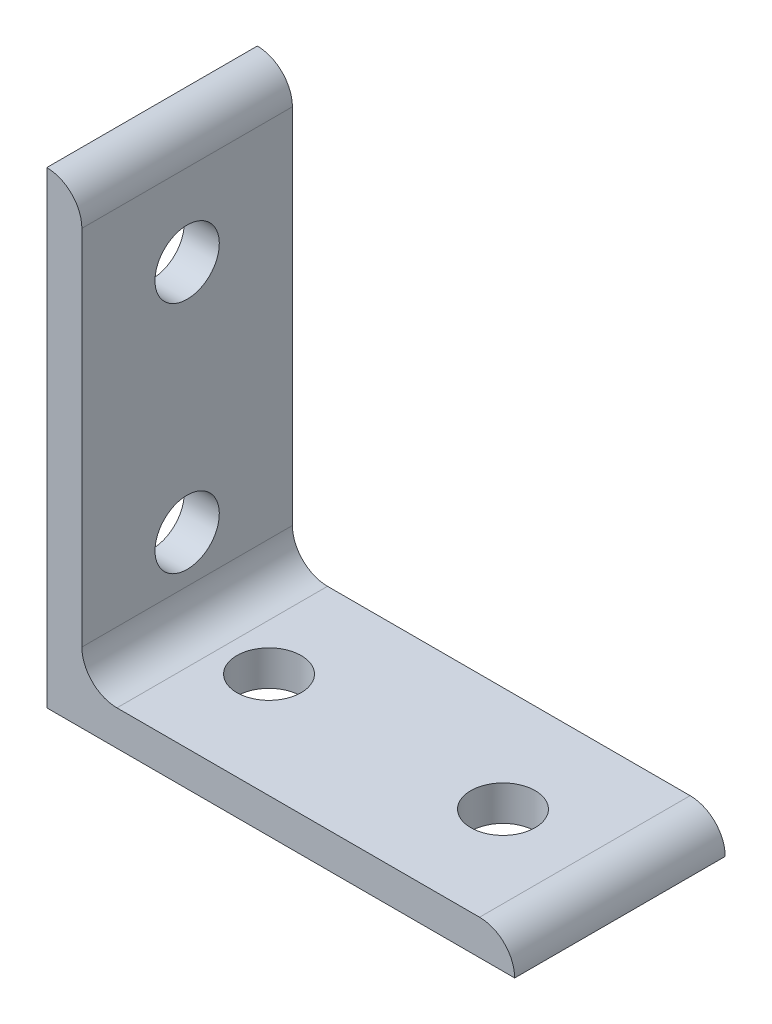
ISO-10303-21;
HEADER;
FILE_DESCRIPTION(('STEP AP214'),'2;1');
FILE_NAME('part.step','',(''),(''),'','','');
FILE_SCHEMA(('AUTOMOTIVE_DESIGN { 1 0 10303 214 1 1 1 1 }'));
ENDSEC;
DATA;
#1=APPLICATION_CONTEXT('core data for automotive mechanical design processes');
#2=APPLICATION_PROTOCOL_DEFINITION('international standard','automotive_design',2000,#1);
#3=PRODUCT_CONTEXT('',#1,'mechanical');
#4=PRODUCT('Part','Part','',(#3));
#5=PRODUCT_RELATED_PRODUCT_CATEGORY('part','',(#4));
#6=PRODUCT_DEFINITION_FORMATION('','',#4);
#7=PRODUCT_DEFINITION_CONTEXT('part definition',#1,'design');
#8=PRODUCT_DEFINITION('design','',#6,#7);
#9=PRODUCT_DEFINITION_SHAPE('','',#8);
#10=(LENGTH_UNIT() NAMED_UNIT(*) SI_UNIT(.MILLI.,.METRE.));
#11=(NAMED_UNIT(*) PLANE_ANGLE_UNIT() SI_UNIT($,.RADIAN.));
#12=(NAMED_UNIT(*) SI_UNIT($,.STERADIAN.) SOLID_ANGLE_UNIT());
#13=UNCERTAINTY_MEASURE_WITH_UNIT(LENGTH_MEASURE(1.E-05),#10,'distance_accuracy_value','');
#14=(GEOMETRIC_REPRESENTATION_CONTEXT(3) GLOBAL_UNCERTAINTY_ASSIGNED_CONTEXT((#13)) GLOBAL_UNIT_ASSIGNED_CONTEXT((#10,
#11,#12)) REPRESENTATION_CONTEXT('',''));
#15=CARTESIAN_POINT('',(0.,0.,0.));
#16=DIRECTION('',(0.,0.,1.));
#17=DIRECTION('',(1.,0.,0.));
#18=AXIS2_PLACEMENT_3D('',#15,#16,#17);
#19=CARTESIAN_POINT('',(3.,37.,9.));
#20=DIRECTION('',(-1.,0.,0.));
#21=DIRECTION('',(0.,-1.,0.));
#22=AXIS2_PLACEMENT_3D('',#19,#20,#21);
#23=PLANE('',#22);
#24=CARTESIAN_POINT('',(3.,10.,0.));
#25=DIRECTION('',(-1.,0.,0.));
#26=DIRECTION('',(0.,-1.,0.));
#27=AXIS2_PLACEMENT_3D('',#24,#25,#26);
#28=CIRCLE('',#27,2.75);
#29=CARTESIAN_POINT('',(3.,7.25000000000001,0.));
#30=VERTEX_POINT('',#29);
#31=EDGE_CURVE('E196',#30,#30,#28,.F.);
#32=ORIENTED_EDGE('',*,*,#31,.F.);
#33=EDGE_LOOP('',(#32));
#34=FACE_BOUND('',#33,.T.);
#35=DIRECTION('',(0.,1.,0.));
#36=VECTOR('',#35,1.);
#37=CARTESIAN_POINT('',(3.,37.,-9.));
#38=LINE('',#37,#36);
#39=CARTESIAN_POINT('',(3.,6.,-9.));
#40=VERTEX_POINT('',#39);
#41=CARTESIAN_POINT('',(3.,37.,-9.));
#42=VERTEX_POINT('',#41);
#43=EDGE_CURVE('E117',#40,#42,#38,.T.);
#44=ORIENTED_EDGE('',*,*,#43,.T.);
#45=DIRECTION('',(0.,0.,-1.));
#46=VECTOR('',#45,1.);
#47=CARTESIAN_POINT('',(3.,37.,9.));
#48=LINE('',#47,#46);
#49=CARTESIAN_POINT('',(3.,37.,9.));
#50=VERTEX_POINT('',#49);
#51=EDGE_CURVE('E114',#50,#42,#48,.T.);
#52=ORIENTED_EDGE('',*,*,#51,.F.);
#53=DIRECTION('',(0.,1.,0.));
#54=VECTOR('',#53,1.);
#55=CARTESIAN_POINT('',(3.,37.,9.));
#56=LINE('',#55,#54);
#57=CARTESIAN_POINT('',(3.,6.,9.));
#58=VERTEX_POINT('',#57);
#59=EDGE_CURVE('E103',#58,#50,#56,.T.);
#60=ORIENTED_EDGE('',*,*,#59,.F.);
#61=DIRECTION('',(0.,0.,-1.));
#62=VECTOR('',#61,1.);
#63=CARTESIAN_POINT('',(3.,6.,9.));
#64=LINE('',#63,#62);
#65=EDGE_CURVE('E118',#58,#40,#64,.T.);
#66=ORIENTED_EDGE('',*,*,#65,.T.);
#67=EDGE_LOOP('',(#44,#52,#60,#66));
#68=FACE_BOUND('',#67,.T.);
#69=CARTESIAN_POINT('',(3.,30.,0.));
#70=DIRECTION('',(-1.,0.,0.));
#71=DIRECTION('',(0.,-1.,0.));
#72=AXIS2_PLACEMENT_3D('',#69,#70,#71);
#73=CIRCLE('',#72,2.75);
#74=CARTESIAN_POINT('',(3.,27.25,0.));
#75=VERTEX_POINT('',#74);
#76=EDGE_CURVE('E189',#75,#75,#73,.F.);
#77=ORIENTED_EDGE('',*,*,#76,.F.);
#78=EDGE_LOOP('',(#77));
#79=FACE_BOUND('',#78,.T.);
#80=ADVANCED_FACE('F34',(#34,#68,#79),#23,.F.);
#81=CARTESIAN_POINT('',(0.,0.,9.));
#82=DIRECTION('',(1.,0.,0.));
#83=DIRECTION('',(0.,0.,-1.));
#84=AXIS2_PLACEMENT_3D('',#81,#82,#83);
#85=PLANE('',#84);
#86=CARTESIAN_POINT('',(0.,10.,0.));
#87=DIRECTION('',(1.,0.,0.));
#88=DIRECTION('',(0.,0.,-1.));
#89=AXIS2_PLACEMENT_3D('',#86,#87,#88);
#90=CIRCLE('',#89,2.75);
#91=CARTESIAN_POINT('',(0.,10.,-2.75));
#92=VERTEX_POINT('',#91);
#93=EDGE_CURVE('E192',#92,#92,#90,.T.);
#94=ORIENTED_EDGE('',*,*,#93,.T.);
#95=EDGE_LOOP('',(#94));
#96=FACE_BOUND('',#95,.T.);
#97=DIRECTION('',(0.,-1.,0.));
#98=VECTOR('',#97,1.);
#99=CARTESIAN_POINT('',(0.,0.,-9.));
#100=LINE('',#99,#98);
#101=CARTESIAN_POINT('',(0.,40.,-9.));
#102=VERTEX_POINT('',#101);
#103=CARTESIAN_POINT('',(0.,0.,-9.));
#104=VERTEX_POINT('',#103);
#105=EDGE_CURVE('E85',#102,#104,#100,.T.);
#106=ORIENTED_EDGE('',*,*,#105,.T.);
#107=DIRECTION('',(0.,0.,-1.));
#108=VECTOR('',#107,1.);
#109=CARTESIAN_POINT('',(0.,0.,9.));
#110=LINE('',#109,#108);
#111=CARTESIAN_POINT('',(0.,0.,9.));
#112=VERTEX_POINT('',#111);
#113=EDGE_CURVE('E123',#112,#104,#110,.T.);
#114=ORIENTED_EDGE('',*,*,#113,.F.);
#115=DIRECTION('',(0.,-1.,0.));
#116=VECTOR('',#115,1.);
#117=CARTESIAN_POINT('',(0.,0.,9.));
#118=LINE('',#117,#116);
#119=CARTESIAN_POINT('',(0.,40.,9.));
#120=VERTEX_POINT('',#119);
#121=EDGE_CURVE('E53',#120,#112,#118,.T.);
#122=ORIENTED_EDGE('',*,*,#121,.F.);
#123=DIRECTION('',(0.,0.,-1.));
#124=VECTOR('',#123,1.);
#125=CARTESIAN_POINT('',(0.,40.,9.));
#126=LINE('',#125,#124);
#127=EDGE_CURVE('E119',#120,#102,#126,.T.);
#128=ORIENTED_EDGE('',*,*,#127,.T.);
#129=EDGE_LOOP('',(#106,#114,#122,#128));
#130=FACE_BOUND('',#129,.T.);
#131=CARTESIAN_POINT('',(0.,30.,0.));
#132=DIRECTION('',(1.,0.,0.));
#133=DIRECTION('',(0.,0.,-1.));
#134=AXIS2_PLACEMENT_3D('',#131,#132,#133);
#135=CIRCLE('',#134,2.75);
#136=CARTESIAN_POINT('',(0.,30.,-2.75));
#137=VERTEX_POINT('',#136);
#138=EDGE_CURVE('E187',#137,#137,#135,.T.);
#139=ORIENTED_EDGE('',*,*,#138,.T.);
#140=EDGE_LOOP('',(#139));
#141=FACE_BOUND('',#140,.T.);
#142=ADVANCED_FACE('F180',(#96,#130,#141),#85,.F.);
#143=CARTESIAN_POINT('',(40.,0.,9.));
#144=DIRECTION('',(0.,1.,0.));
#145=DIRECTION('',(-1.,0.,0.));
#146=AXIS2_PLACEMENT_3D('',#143,#144,#145);
#147=PLANE('',#146);
#148=CARTESIAN_POINT('',(10.,0.,0.));
#149=DIRECTION('',(0.,1.,0.));
#150=DIRECTION('',(0.,0.,1.));
#151=AXIS2_PLACEMENT_3D('',#148,#149,#150);
#152=CIRCLE('',#151,2.75);
#153=CARTESIAN_POINT('',(10.,0.,2.75));
#154=VERTEX_POINT('',#153);
#155=EDGE_CURVE('E149',#154,#154,#152,.T.);
#156=ORIENTED_EDGE('',*,*,#155,.T.);
#157=EDGE_LOOP('',(#156));
#158=FACE_BOUND('',#157,.T.);
#159=DIRECTION('',(1.,0.,0.));
#160=VECTOR('',#159,1.);
#161=CARTESIAN_POINT('',(40.,0.,-9.));
#162=LINE('',#161,#160);
#163=CARTESIAN_POINT('',(40.,0.,-9.));
#164=VERTEX_POINT('',#163);
#165=EDGE_CURVE('E127',#104,#164,#162,.T.);
#166=ORIENTED_EDGE('',*,*,#165,.T.);
#167=DIRECTION('',(0.,0.,-1.));
#168=VECTOR('',#167,1.);
#169=CARTESIAN_POINT('',(40.,0.,9.));
#170=LINE('',#169,#168);
#171=CARTESIAN_POINT('',(40.,0.,9.));
#172=VERTEX_POINT('',#171);
#173=EDGE_CURVE('E11',#172,#164,#170,.T.);
#174=ORIENTED_EDGE('',*,*,#173,.F.);
#175=DIRECTION('',(1.,0.,0.));
#176=VECTOR('',#175,1.);
#177=CARTESIAN_POINT('',(40.,0.,9.));
#178=LINE('',#177,#176);
#179=EDGE_CURVE('E140',#112,#172,#178,.T.);
#180=ORIENTED_EDGE('',*,*,#179,.F.);
#181=ORIENTED_EDGE('',*,*,#113,.T.);
#182=EDGE_LOOP('',(#166,#174,#180,#181));
#183=FACE_BOUND('',#182,.T.);
#184=CARTESIAN_POINT('',(30.,0.,0.));
#185=DIRECTION('',(0.,1.,0.));
#186=DIRECTION('',(0.,0.,1.));
#187=AXIS2_PLACEMENT_3D('',#184,#185,#186);
#188=CIRCLE('',#187,2.74999999999999);
#189=CARTESIAN_POINT('',(30.,0.,2.74999999999999));
#190=VERTEX_POINT('',#189);
#191=EDGE_CURVE('E157',#190,#190,#188,.T.);
#192=ORIENTED_EDGE('',*,*,#191,.T.);
#193=EDGE_LOOP('',(#192));
#194=FACE_BOUND('',#193,.T.);
#195=ADVANCED_FACE('F36',(#158,#183,#194),#147,.F.);
#196=CARTESIAN_POINT('',(6.,3.,9.));
#197=DIRECTION('',(0.,-1.,0.));
#198=DIRECTION('',(1.,0.,0.));
#199=AXIS2_PLACEMENT_3D('',#196,#197,#198);
#200=PLANE('',#199);
#201=CARTESIAN_POINT('',(10.,3.,0.));
#202=DIRECTION('',(0.,-1.,0.));
#203=DIRECTION('',(1.,0.,0.));
#204=AXIS2_PLACEMENT_3D('',#201,#202,#203);
#205=CIRCLE('',#204,2.75);
#206=CARTESIAN_POINT('',(12.75,3.,0.));
#207=VERTEX_POINT('',#206);
#208=EDGE_CURVE('E131',#207,#207,#205,.F.);
#209=ORIENTED_EDGE('',*,*,#208,.F.);
#210=EDGE_LOOP('',(#209));
#211=FACE_BOUND('',#210,.T.);
#212=DIRECTION('',(-1.,0.,0.));
#213=VECTOR('',#212,1.);
#214=CARTESIAN_POINT('',(6.,3.,-9.));
#215=LINE('',#214,#213);
#216=CARTESIAN_POINT('',(37.,3.,-9.));
#217=VERTEX_POINT('',#216);
#218=CARTESIAN_POINT('',(6.,3.,-9.));
#219=VERTEX_POINT('',#218);
#220=EDGE_CURVE('E133',#217,#219,#215,.T.);
#221=ORIENTED_EDGE('',*,*,#220,.T.);
#222=DIRECTION('',(0.,0.,-1.));
#223=VECTOR('',#222,1.);
#224=CARTESIAN_POINT('',(6.,3.,9.));
#225=LINE('',#224,#223);
#226=CARTESIAN_POINT('',(6.,3.,9.));
#227=VERTEX_POINT('',#226);
#228=EDGE_CURVE('E144',#227,#219,#225,.T.);
#229=ORIENTED_EDGE('',*,*,#228,.F.);
#230=DIRECTION('',(-1.,0.,0.));
#231=VECTOR('',#230,1.);
#232=CARTESIAN_POINT('',(6.,3.,9.));
#233=LINE('',#232,#231);
#234=CARTESIAN_POINT('',(37.,3.,9.));
#235=VERTEX_POINT('',#234);
#236=EDGE_CURVE('E163',#235,#227,#233,.T.);
#237=ORIENTED_EDGE('',*,*,#236,.F.);
#238=DIRECTION('',(0.,0.,-1.));
#239=VECTOR('',#238,1.);
#240=CARTESIAN_POINT('',(37.,3.,9.));
#241=LINE('',#240,#239);
#242=EDGE_CURVE('E44',#235,#217,#241,.T.);
#243=ORIENTED_EDGE('',*,*,#242,.T.);
#244=EDGE_LOOP('',(#221,#229,#237,#243));
#245=FACE_BOUND('',#244,.T.);
#246=CARTESIAN_POINT('',(30.,3.,0.));
#247=DIRECTION('',(0.,-1.,0.));
#248=DIRECTION('',(1.,0.,0.));
#249=AXIS2_PLACEMENT_3D('',#246,#247,#248);
#250=CIRCLE('',#249,2.74999999999999);
#251=CARTESIAN_POINT('',(32.75,3.,0.));
#252=VERTEX_POINT('',#251);
#253=EDGE_CURVE('E38',#252,#252,#250,.F.);
#254=ORIENTED_EDGE('',*,*,#253,.F.);
#255=EDGE_LOOP('',(#254));
#256=FACE_BOUND('',#255,.T.);
#257=ADVANCED_FACE('F167',(#211,#245,#256),#200,.F.);
#258=CARTESIAN_POINT('',(37.,0.,9.));
#259=DIRECTION('',(0.,0.,-1.));
#260=DIRECTION('',(-1.,0.,0.));
#261=AXIS2_PLACEMENT_3D('',#258,#259,#260);
#262=CYLINDRICAL_SURFACE('',#261,3.00000000000001);
#263=CARTESIAN_POINT('',(37.,0.,-9.));
#264=DIRECTION('',(0.,0.,1.));
#265=DIRECTION('',(1.,0.,0.));
#266=AXIS2_PLACEMENT_3D('',#263,#264,#265);
#267=CIRCLE('',#266,3.00000000000001);
#268=EDGE_CURVE('E130',#164,#217,#267,.T.);
#269=ORIENTED_EDGE('',*,*,#268,.T.);
#270=ORIENTED_EDGE('',*,*,#242,.F.);
#271=CARTESIAN_POINT('',(37.,0.,9.));
#272=DIRECTION('',(0.,0.,1.));
#273=DIRECTION('',(1.,0.,0.));
#274=AXIS2_PLACEMENT_3D('',#271,#272,#273);
#275=CIRCLE('',#274,3.00000000000001);
#276=EDGE_CURVE('E93',#172,#235,#275,.T.);
#277=ORIENTED_EDGE('',*,*,#276,.F.);
#278=ORIENTED_EDGE('',*,*,#173,.T.);
#279=EDGE_LOOP('',(#269,#270,#277,#278));
#280=FACE_BOUND('',#279,.T.);
#281=ADVANCED_FACE('F211',(#280),#262,.T.);
#282=CARTESIAN_POINT('',(6.,6.,9.));
#283=DIRECTION('',(0.,0.,-1.));
#284=DIRECTION('',(-1.,0.,0.));
#285=AXIS2_PLACEMENT_3D('',#282,#283,#284);
#286=CYLINDRICAL_SURFACE('',#285,3.);
#287=CARTESIAN_POINT('',(6.,6.,-9.));
#288=DIRECTION('',(0.,0.,-1.));
#289=DIRECTION('',(1.,0.,0.));
#290=AXIS2_PLACEMENT_3D('',#287,#288,#289);
#291=CIRCLE('',#290,3.);
#292=EDGE_CURVE('E135',#219,#40,#291,.T.);
#293=ORIENTED_EDGE('',*,*,#292,.T.);
#294=ORIENTED_EDGE('',*,*,#65,.F.);
#295=CARTESIAN_POINT('',(6.,6.,9.));
#296=DIRECTION('',(0.,0.,-1.));
#297=DIRECTION('',(1.,0.,0.));
#298=AXIS2_PLACEMENT_3D('',#295,#296,#297);
#299=CIRCLE('',#298,3.);
#300=EDGE_CURVE('E109',#227,#58,#299,.T.);
#301=ORIENTED_EDGE('',*,*,#300,.F.);
#302=ORIENTED_EDGE('',*,*,#228,.T.);
#303=EDGE_LOOP('',(#293,#294,#301,#302));
#304=FACE_BOUND('',#303,.T.);
#305=ADVANCED_FACE('F172',(#304),#286,.F.);
#306=CARTESIAN_POINT('',(0.,37.,9.));
#307=DIRECTION('',(0.,0.,-1.));
#308=DIRECTION('',(-1.,0.,0.));
#309=AXIS2_PLACEMENT_3D('',#306,#307,#308);
#310=CYLINDRICAL_SURFACE('',#309,3.00000000000001);
#311=CARTESIAN_POINT('',(0.,37.,-9.));
#312=DIRECTION('',(0.,0.,1.));
#313=DIRECTION('',(1.,0.,0.));
#314=AXIS2_PLACEMENT_3D('',#311,#312,#313);
#315=CIRCLE('',#314,3.00000000000001);
#316=EDGE_CURVE('E79',#42,#102,#315,.T.);
#317=ORIENTED_EDGE('',*,*,#316,.T.);
#318=ORIENTED_EDGE('',*,*,#127,.F.);
#319=CARTESIAN_POINT('',(0.,37.,9.));
#320=DIRECTION('',(0.,0.,1.));
#321=DIRECTION('',(1.,0.,0.));
#322=AXIS2_PLACEMENT_3D('',#319,#320,#321);
#323=CIRCLE('',#322,3.00000000000001);
#324=EDGE_CURVE('E107',#50,#120,#323,.T.);
#325=ORIENTED_EDGE('',*,*,#324,.F.);
#326=ORIENTED_EDGE('',*,*,#51,.T.);
#327=EDGE_LOOP('',(#317,#318,#325,#326));
#328=FACE_BOUND('',#327,.T.);
#329=ADVANCED_FACE('F121',(#328),#310,.T.);
#330=CARTESIAN_POINT('',(0.,37.,9.));
#331=DIRECTION('',(0.,0.,1.));
#332=DIRECTION('',(1.,0.,0.));
#333=AXIS2_PLACEMENT_3D('',#330,#331,#332);
#334=PLANE('',#333);
#335=ORIENTED_EDGE('',*,*,#179,.T.);
#336=ORIENTED_EDGE('',*,*,#276,.T.);
#337=ORIENTED_EDGE('',*,*,#236,.T.);
#338=ORIENTED_EDGE('',*,*,#300,.T.);
#339=ORIENTED_EDGE('',*,*,#59,.T.);
#340=ORIENTED_EDGE('',*,*,#324,.T.);
#341=ORIENTED_EDGE('',*,*,#121,.T.);
#342=EDGE_LOOP('',(#335,#336,#337,#338,#339,#340,#341));
#343=FACE_BOUND('',#342,.T.);
#344=ADVANCED_FACE('F105',(#343),#334,.T.);
#345=CARTESIAN_POINT('',(0.,37.,-9.));
#346=DIRECTION('',(0.,0.,1.));
#347=DIRECTION('',(1.,0.,0.));
#348=AXIS2_PLACEMENT_3D('',#345,#346,#347);
#349=PLANE('',#348);
#350=ORIENTED_EDGE('',*,*,#165,.F.);
#351=ORIENTED_EDGE('',*,*,#105,.F.);
#352=ORIENTED_EDGE('',*,*,#316,.F.);
#353=ORIENTED_EDGE('',*,*,#43,.F.);
#354=ORIENTED_EDGE('',*,*,#292,.F.);
#355=ORIENTED_EDGE('',*,*,#220,.F.);
#356=ORIENTED_EDGE('',*,*,#268,.F.);
#357=EDGE_LOOP('',(#350,#351,#352,#353,#354,#355,#356));
#358=FACE_BOUND('',#357,.T.);
#359=ADVANCED_FACE('F175',(#358),#349,.F.);
#360=CARTESIAN_POINT('',(10.,40.,0.));
#361=DIRECTION('',(0.,-1.,0.));
#362=DIRECTION('',(0.,0.,-1.));
#363=AXIS2_PLACEMENT_3D('',#360,#361,#362);
#364=CYLINDRICAL_SURFACE('',#363,2.75);
#365=ORIENTED_EDGE('',*,*,#155,.F.);
#366=EDGE_LOOP('',(#365));
#367=FACE_BOUND('',#366,.T.);
#368=ORIENTED_EDGE('',*,*,#208,.T.);
#369=EDGE_LOOP('',(#368));
#370=FACE_BOUND('',#369,.T.);
#371=ADVANCED_FACE('F207',(#367,#370),#364,.F.);
#372=CARTESIAN_POINT('',(30.,40.,0.));
#373=DIRECTION('',(0.,-1.,0.));
#374=DIRECTION('',(0.,0.,-1.));
#375=AXIS2_PLACEMENT_3D('',#372,#373,#374);
#376=CYLINDRICAL_SURFACE('',#375,2.74999999999999);
#377=ORIENTED_EDGE('',*,*,#191,.F.);
#378=EDGE_LOOP('',(#377));
#379=FACE_BOUND('',#378,.T.);
#380=ORIENTED_EDGE('',*,*,#253,.T.);
#381=EDGE_LOOP('',(#380));
#382=FACE_BOUND('',#381,.T.);
#383=ADVANCED_FACE('F203',(#379,#382),#376,.F.);
#384=CARTESIAN_POINT('',(40.,10.,0.));
#385=DIRECTION('',(-1.,0.,0.));
#386=DIRECTION('',(0.,0.,1.));
#387=AXIS2_PLACEMENT_3D('',#384,#385,#386);
#388=CYLINDRICAL_SURFACE('',#387,2.75);
#389=ORIENTED_EDGE('',*,*,#93,.F.);
#390=EDGE_LOOP('',(#389));
#391=FACE_BOUND('',#390,.T.);
#392=ORIENTED_EDGE('',*,*,#31,.T.);
#393=EDGE_LOOP('',(#392));
#394=FACE_BOUND('',#393,.T.);
#395=ADVANCED_FACE('F206',(#391,#394),#388,.F.);
#396=CARTESIAN_POINT('',(40.,30.,0.));
#397=DIRECTION('',(-1.,0.,0.));
#398=DIRECTION('',(0.,0.,1.));
#399=AXIS2_PLACEMENT_3D('',#396,#397,#398);
#400=CYLINDRICAL_SURFACE('',#399,2.75);
#401=ORIENTED_EDGE('',*,*,#138,.F.);
#402=EDGE_LOOP('',(#401));
#403=FACE_BOUND('',#402,.T.);
#404=ORIENTED_EDGE('',*,*,#76,.T.);
#405=EDGE_LOOP('',(#404));
#406=FACE_BOUND('',#405,.T.);
#407=ADVANCED_FACE('F243',(#403,#406),#400,.F.);
#408=CLOSED_SHELL('',(#80,#142,#195,#257,#281,#305,#329,#344,#359,#371,#383,#395,#407));
#409=MANIFOLD_SOLID_BREP('B2',#408);
#410=ADVANCED_BREP_SHAPE_REPRESENTATION('',(#18,#409),#14);
#411=SHAPE_DEFINITION_REPRESENTATION(#9,#410);
ENDSEC;
END-ISO-10303-21;
